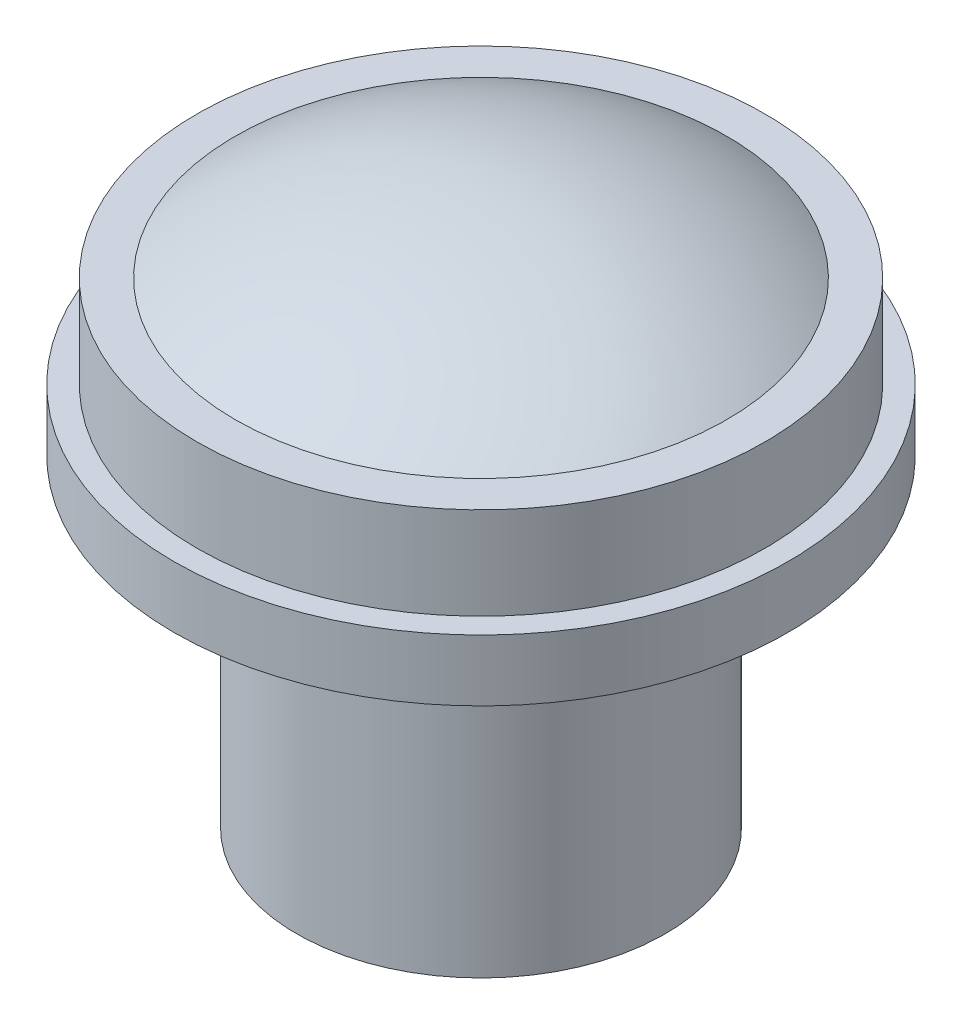
ISO-10303-21;
HEADER;
FILE_DESCRIPTION(('STEP AP214'),'2;1');
FILE_NAME('part.step','',(''),(''),'','','');
FILE_SCHEMA(('AUTOMOTIVE_DESIGN { 1 0 10303 214 1 1 1 1 }'));
ENDSEC;
DATA;
#1=APPLICATION_CONTEXT('core data for automotive mechanical design processes');
#2=APPLICATION_PROTOCOL_DEFINITION('international standard','automotive_design',2000,#1);
#3=PRODUCT_CONTEXT('',#1,'mechanical');
#4=PRODUCT('Part','Part','',(#3));
#5=PRODUCT_RELATED_PRODUCT_CATEGORY('part','',(#4));
#6=PRODUCT_DEFINITION_FORMATION('','',#4);
#7=PRODUCT_DEFINITION_CONTEXT('part definition',#1,'design');
#8=PRODUCT_DEFINITION('design','',#6,#7);
#9=PRODUCT_DEFINITION_SHAPE('','',#8);
#10=(LENGTH_UNIT() NAMED_UNIT(*) SI_UNIT(.MILLI.,.METRE.));
#11=(NAMED_UNIT(*) PLANE_ANGLE_UNIT() SI_UNIT($,.RADIAN.));
#12=(NAMED_UNIT(*) SI_UNIT($,.STERADIAN.) SOLID_ANGLE_UNIT());
#13=UNCERTAINTY_MEASURE_WITH_UNIT(LENGTH_MEASURE(1.E-05),#10,'distance_accuracy_value','');
#14=(GEOMETRIC_REPRESENTATION_CONTEXT(3) GLOBAL_UNCERTAINTY_ASSIGNED_CONTEXT((#13)) GLOBAL_UNIT_ASSIGNED_CONTEXT((#10,
#11,#12)) REPRESENTATION_CONTEXT('',''));
#15=CARTESIAN_POINT('',(0.,0.,0.));
#16=DIRECTION('',(0.,0.,1.));
#17=DIRECTION('',(1.,0.,0.));
#18=AXIS2_PLACEMENT_3D('',#15,#16,#17);
#19=CARTESIAN_POINT('',(0.,12.5,0.));
#20=DIRECTION('',(0.,-1.,0.));
#21=DIRECTION('',(0.,0.,-1.));
#22=AXIS2_PLACEMENT_3D('',#19,#20,#21);
#23=CYLINDRICAL_SURFACE('',#22,9.25);
#24=CARTESIAN_POINT('',(0.,12.5,0.));
#25=DIRECTION('',(0.,1.,0.));
#26=DIRECTION('',(0.,0.,1.));
#27=AXIS2_PLACEMENT_3D('',#24,#25,#26);
#28=CIRCLE('',#27,9.25);
#29=CARTESIAN_POINT('',(0.,12.5,9.25));
#30=VERTEX_POINT('',#29);
#31=EDGE_CURVE('E50',#30,#30,#28,.T.);
#32=ORIENTED_EDGE('',*,*,#31,.T.);
#33=EDGE_LOOP('',(#32));
#34=FACE_BOUND('',#33,.T.);
#35=CARTESIAN_POINT('',(0.,10.5,0.));
#36=DIRECTION('',(0.,1.,0.));
#37=DIRECTION('',(0.,0.,1.));
#38=AXIS2_PLACEMENT_3D('',#35,#36,#37);
#39=CIRCLE('',#38,9.25);
#40=CARTESIAN_POINT('',(0.,10.5,9.25));
#41=VERTEX_POINT('',#40);
#42=EDGE_CURVE('E56',#41,#41,#39,.T.);
#43=ORIENTED_EDGE('',*,*,#42,.F.);
#44=EDGE_LOOP('',(#43));
#45=FACE_BOUND('',#44,.T.);
#46=ADVANCED_FACE('F43',(#34,#45),#23,.F.);
#47=CARTESIAN_POINT('',(0.,12.5,0.));
#48=DIRECTION('',(0.,-1.,0.));
#49=DIRECTION('',(0.,0.,-1.));
#50=AXIS2_PLACEMENT_3D('',#47,#48,#49);
#51=CYLINDRICAL_SURFACE('',#50,10.);
#52=CARTESIAN_POINT('',(0.,12.5,0.));
#53=DIRECTION('',(0.,1.,0.));
#54=DIRECTION('',(0.,0.,1.));
#55=AXIS2_PLACEMENT_3D('',#52,#53,#54);
#56=CIRCLE('',#55,10.);
#57=CARTESIAN_POINT('',(0.,12.5,10.));
#58=VERTEX_POINT('',#57);
#59=EDGE_CURVE('E11',#58,#58,#56,.T.);
#60=ORIENTED_EDGE('',*,*,#59,.F.);
#61=EDGE_LOOP('',(#60));
#62=FACE_BOUND('',#61,.T.);
#63=CARTESIAN_POINT('',(0.,10.5,0.));
#64=DIRECTION('',(0.,1.,0.));
#65=DIRECTION('',(0.,0.,1.));
#66=AXIS2_PLACEMENT_3D('',#63,#64,#65);
#67=CIRCLE('',#66,10.);
#68=CARTESIAN_POINT('',(0.,10.5,10.));
#69=VERTEX_POINT('',#68);
#70=EDGE_CURVE('E46',#69,#69,#67,.T.);
#71=ORIENTED_EDGE('',*,*,#70,.T.);
#72=EDGE_LOOP('',(#71));
#73=FACE_BOUND('',#72,.T.);
#74=ADVANCED_FACE('F63',(#62,#73),#51,.T.);
#75=CARTESIAN_POINT('',(0.,12.5,0.));
#76=DIRECTION('',(0.,1.,0.));
#77=DIRECTION('',(0.,0.,1.));
#78=AXIS2_PLACEMENT_3D('',#75,#76,#77);
#79=PLANE('',#78);
#80=ORIENTED_EDGE('',*,*,#31,.F.);
#81=EDGE_LOOP('',(#80));
#82=FACE_BOUND('',#81,.T.);
#83=ORIENTED_EDGE('',*,*,#59,.T.);
#84=EDGE_LOOP('',(#83));
#85=FACE_BOUND('',#84,.T.);
#86=ADVANCED_FACE('F67',(#82,#85),#79,.T.);
#87=CARTESIAN_POINT('',(0.,10.5,0.));
#88=DIRECTION('',(0.,1.,0.));
#89=DIRECTION('',(0.,0.,1.));
#90=AXIS2_PLACEMENT_3D('',#87,#88,#89);
#91=PLANE('',#90);
#92=ORIENTED_EDGE('',*,*,#42,.T.);
#93=EDGE_LOOP('',(#92));
#94=FACE_BOUND('',#93,.T.);
#95=ORIENTED_EDGE('',*,*,#70,.F.);
#96=EDGE_LOOP('',(#95));
#97=FACE_BOUND('',#96,.T.);
#98=ADVANCED_FACE('F65',(#94,#97),#91,.F.);
#99=CLOSED_SHELL('',(#46,#74,#86,#98));
#100=MANIFOLD_SOLID_BREP('B2',#99);
#101=CARTESIAN_POINT('',(0.,10.4,0.));
#102=DIRECTION('',(0.,1.,0.));
#103=DIRECTION('',(0.,0.,1.));
#104=AXIS2_PLACEMENT_3D('',#101,#102,#103);
#105=CYLINDRICAL_SURFACE('',#104,2.25);
#106=CARTESIAN_POINT('',(0.,10.4,0.));
#107=DIRECTION('',(0.,1.,0.));
#108=DIRECTION('',(0.,0.,1.));
#109=AXIS2_PLACEMENT_3D('',#106,#107,#108);
#110=CIRCLE('',#109,2.25);
#111=CARTESIAN_POINT('',(0.,10.4,2.25));
#112=VERTEX_POINT('',#111);
#113=EDGE_CURVE('E42',#112,#112,#110,.F.);
#114=ORIENTED_EDGE('',*,*,#113,.F.);
#115=EDGE_LOOP('',(#114));
#116=FACE_BOUND('',#115,.T.);
#117=CARTESIAN_POINT('',(0.,10.5,0.));
#118=DIRECTION('',(0.,1.,0.));
#119=DIRECTION('',(0.,0.,1.));
#120=AXIS2_PLACEMENT_3D('',#117,#118,#119);
#121=CIRCLE('',#120,2.25);
#122=CARTESIAN_POINT('',(0.,10.5,2.25));
#123=VERTEX_POINT('',#122);
#124=EDGE_CURVE('E116',#123,#123,#121,.F.);
#125=ORIENTED_EDGE('',*,*,#124,.T.);
#126=EDGE_LOOP('',(#125));
#127=FACE_BOUND('',#126,.T.);
#128=ADVANCED_FACE('F112',(#116,#127),#105,.T.);
#129=CARTESIAN_POINT('',(0.,10.4,0.));
#130=DIRECTION('',(0.,1.,0.));
#131=DIRECTION('',(0.,0.,1.));
#132=AXIS2_PLACEMENT_3D('',#129,#130,#131);
#133=PLANE('',#132);
#134=ORIENTED_EDGE('',*,*,#113,.T.);
#135=EDGE_LOOP('',(#134));
#136=FACE_BOUND('',#135,.T.);
#137=ADVANCED_FACE('F127',(#136),#133,.F.);
#138=CARTESIAN_POINT('',(0.,10.7375,0.));
#139=DIRECTION('',(0.,0.,1.));
#140=DIRECTION('',(1.,0.,0.));
#141=AXIS2_PLACEMENT_3D('',#138,#139,#140);
#142=SPHERICAL_SURFACE('',#141,2.2625);
#143=CARTESIAN_POINT('',(0.,10.7375,0.));
#144=DIRECTION('',(0.,1.,0.));
#145=DIRECTION('',(0.,0.,1.));
#146=AXIS2_PLACEMENT_3D('',#143,#144,#145);
#147=SPHERICAL_SURFACE('',#146,2.2625);
#148=ORIENTED_EDGE('',*,*,#124,.F.);
#149=EDGE_LOOP('',(#148));
#150=FACE_BOUND('',#149,.T.);
#151=ADVANCED_FACE('F114',(#150),#147,.T.);
#152=CLOSED_SHELL('',(#128,#137,#151));
#153=MANIFOLD_SOLID_BREP('B6',#152);
#154=CARTESIAN_POINT('',(0.,15.5,0.));
#155=DIRECTION('',(0.,-1.,0.));
#156=DIRECTION('',(0.,0.,-1.));
#157=AXIS2_PLACEMENT_3D('',#154,#155,#156);
#158=CYLINDRICAL_SURFACE('',#157,8.);
#159=CARTESIAN_POINT('',(0.,15.5,0.));
#160=DIRECTION('',(0.,1.,0.));
#161=DIRECTION('',(0.,0.,1.));
#162=AXIS2_PLACEMENT_3D('',#159,#160,#161);
#163=CIRCLE('',#162,8.);
#164=CARTESIAN_POINT('',(0.,15.5,8.));
#165=VERTEX_POINT('',#164);
#166=EDGE_CURVE('E111',#165,#165,#163,.T.);
#167=ORIENTED_EDGE('',*,*,#166,.F.);
#168=EDGE_LOOP('',(#167));
#169=FACE_BOUND('',#168,.T.);
#170=CARTESIAN_POINT('',(0.,10.5,0.));
#171=DIRECTION('',(0.,1.,0.));
#172=DIRECTION('',(0.,0.,1.));
#173=AXIS2_PLACEMENT_3D('',#170,#171,#172);
#174=CIRCLE('',#173,8.);
#175=CARTESIAN_POINT('',(0.,10.5,8.));
#176=VERTEX_POINT('',#175);
#177=EDGE_CURVE('E170',#176,#176,#174,.T.);
#178=ORIENTED_EDGE('',*,*,#177,.T.);
#179=EDGE_LOOP('',(#178));
#180=FACE_BOUND('',#179,.T.);
#181=ADVANCED_FACE('F163',(#169,#180),#158,.T.);
#182=CARTESIAN_POINT('',(0.,3.95,0.));
#183=DIRECTION('',(0.,0.,1.));
#184=DIRECTION('',(1.,0.,0.));
#185=AXIS2_PLACEMENT_3D('',#182,#183,#184);
#186=SPHERICAL_SURFACE('',#185,14.05);
#187=CARTESIAN_POINT('',(0.,3.95,0.));
#188=DIRECTION('',(0.,1.,0.));
#189=DIRECTION('',(0.,0.,1.));
#190=AXIS2_PLACEMENT_3D('',#187,#188,#189);
#191=SPHERICAL_SURFACE('',#190,14.05);
#192=ORIENTED_EDGE('',*,*,#166,.T.);
#193=EDGE_LOOP('',(#192));
#194=FACE_BOUND('',#193,.T.);
#195=ADVANCED_FACE('F165',(#194),#191,.T.);
#196=CARTESIAN_POINT('',(0.,10.5,0.));
#197=DIRECTION('',(0.,1.,0.));
#198=DIRECTION('',(0.,0.,1.));
#199=AXIS2_PLACEMENT_3D('',#196,#197,#198);
#200=PLANE('',#199);
#201=ORIENTED_EDGE('',*,*,#177,.F.);
#202=EDGE_LOOP('',(#201));
#203=FACE_BOUND('',#202,.T.);
#204=ADVANCED_FACE('F177',(#203),#200,.F.);
#205=CLOSED_SHELL('',(#181,#195,#204));
#206=MANIFOLD_SOLID_BREP('B37',#205);
#207=CARTESIAN_POINT('',(0.,15.5,0.));
#208=DIRECTION('',(0.,-1.,0.));
#209=DIRECTION('',(0.,0.,-1.));
#210=AXIS2_PLACEMENT_3D('',#207,#208,#209);
#211=CYLINDRICAL_SURFACE('',#210,8.);
#212=CARTESIAN_POINT('',(0.,15.5,0.));
#213=DIRECTION('',(0.,1.,0.));
#214=DIRECTION('',(0.,0.,1.));
#215=AXIS2_PLACEMENT_3D('',#212,#213,#214);
#216=CIRCLE('',#215,8.);
#217=CARTESIAN_POINT('',(0.,15.5,8.));
#218=VERTEX_POINT('',#217);
#219=EDGE_CURVE('E217',#218,#218,#216,.T.);
#220=ORIENTED_EDGE('',*,*,#219,.T.);
#221=EDGE_LOOP('',(#220));
#222=FACE_BOUND('',#221,.T.);
#223=CARTESIAN_POINT('',(0.,10.5,0.));
#224=DIRECTION('',(0.,1.,0.));
#225=DIRECTION('',(0.,0.,1.));
#226=AXIS2_PLACEMENT_3D('',#223,#224,#225);
#227=CIRCLE('',#226,8.);
#228=CARTESIAN_POINT('',(0.,10.5,8.));
#229=VERTEX_POINT('',#228);
#230=EDGE_CURVE('E223',#229,#229,#227,.T.);
#231=ORIENTED_EDGE('',*,*,#230,.F.);
#232=EDGE_LOOP('',(#231));
#233=FACE_BOUND('',#232,.T.);
#234=ADVANCED_FACE('F210',(#222,#233),#211,.F.);
#235=CARTESIAN_POINT('',(0.,15.5,0.));
#236=DIRECTION('',(0.,-1.,0.));
#237=DIRECTION('',(0.,0.,-1.));
#238=AXIS2_PLACEMENT_3D('',#235,#236,#237);
#239=CYLINDRICAL_SURFACE('',#238,9.25);
#240=CARTESIAN_POINT('',(0.,15.5,0.));
#241=DIRECTION('',(0.,1.,0.));
#242=DIRECTION('',(0.,0.,1.));
#243=AXIS2_PLACEMENT_3D('',#240,#241,#242);
#244=CIRCLE('',#243,9.25);
#245=CARTESIAN_POINT('',(0.,15.5,9.25));
#246=VERTEX_POINT('',#245);
#247=EDGE_CURVE('E162',#246,#246,#244,.T.);
#248=ORIENTED_EDGE('',*,*,#247,.F.);
#249=EDGE_LOOP('',(#248));
#250=FACE_BOUND('',#249,.T.);
#251=CARTESIAN_POINT('',(0.,10.5,0.));
#252=DIRECTION('',(0.,1.,0.));
#253=DIRECTION('',(0.,0.,1.));
#254=AXIS2_PLACEMENT_3D('',#251,#252,#253);
#255=CIRCLE('',#254,9.25);
#256=CARTESIAN_POINT('',(0.,10.5,9.25));
#257=VERTEX_POINT('',#256);
#258=EDGE_CURVE('E213',#257,#257,#255,.T.);
#259=ORIENTED_EDGE('',*,*,#258,.T.);
#260=EDGE_LOOP('',(#259));
#261=FACE_BOUND('',#260,.T.);
#262=ADVANCED_FACE('F230',(#250,#261),#239,.T.);
#263=CARTESIAN_POINT('',(0.,15.5,0.));
#264=DIRECTION('',(0.,1.,0.));
#265=DIRECTION('',(0.,0.,1.));
#266=AXIS2_PLACEMENT_3D('',#263,#264,#265);
#267=PLANE('',#266);
#268=ORIENTED_EDGE('',*,*,#219,.F.);
#269=EDGE_LOOP('',(#268));
#270=FACE_BOUND('',#269,.T.);
#271=ORIENTED_EDGE('',*,*,#247,.T.);
#272=EDGE_LOOP('',(#271));
#273=FACE_BOUND('',#272,.T.);
#274=ADVANCED_FACE('F234',(#270,#273),#267,.T.);
#275=CARTESIAN_POINT('',(0.,10.5,0.));
#276=DIRECTION('',(0.,1.,0.));
#277=DIRECTION('',(0.,0.,1.));
#278=AXIS2_PLACEMENT_3D('',#275,#276,#277);
#279=PLANE('',#278);
#280=ORIENTED_EDGE('',*,*,#230,.T.);
#281=EDGE_LOOP('',(#280));
#282=FACE_BOUND('',#281,.T.);
#283=ORIENTED_EDGE('',*,*,#258,.F.);
#284=EDGE_LOOP('',(#283));
#285=FACE_BOUND('',#284,.T.);
#286=ADVANCED_FACE('F232',(#282,#285),#279,.F.);
#287=CLOSED_SHELL('',(#234,#262,#274,#286));
#288=MANIFOLD_SOLID_BREP('B106',#287);
#289=CARTESIAN_POINT('',(0.,10.5,0.));
#290=DIRECTION('',(0.,1.,0.));
#291=DIRECTION('',(0.,0.,1.));
#292=AXIS2_PLACEMENT_3D('',#289,#290,#291);
#293=PLANE('',#292);
#294=CARTESIAN_POINT('',(0.,10.5,0.));
#295=DIRECTION('',(0.,1.,0.));
#296=DIRECTION('',(0.,0.,1.));
#297=AXIS2_PLACEMENT_3D('',#294,#295,#296);
#298=CIRCLE('',#297,6.);
#299=CARTESIAN_POINT('',(0.,10.5,-6.));
#300=VERTEX_POINT('',#299);
#301=EDGE_CURVE('E209',#300,#300,#298,.T.);
#302=ORIENTED_EDGE('',*,*,#301,.T.);
#303=EDGE_LOOP('',(#302));
#304=FACE_BOUND('',#303,.T.);
#305=CARTESIAN_POINT('',(0.,10.5,0.));
#306=DIRECTION('',(0.,1.,0.));
#307=DIRECTION('',(0.,0.,1.));
#308=AXIS2_PLACEMENT_3D('',#305,#306,#307);
#309=CIRCLE('',#308,2.25);
#310=CARTESIAN_POINT('',(0.,10.5,-2.25));
#311=VERTEX_POINT('',#310);
#312=EDGE_CURVE('E282',#311,#311,#309,.T.);
#313=ORIENTED_EDGE('',*,*,#312,.F.);
#314=EDGE_LOOP('',(#313));
#315=FACE_BOUND('',#314,.T.);
#316=ADVANCED_FACE('F271',(#304,#315),#293,.T.);
#317=CARTESIAN_POINT('',(0.,0.,0.));
#318=DIRECTION('',(0.,1.,0.));
#319=DIRECTION('',(0.,0.,1.));
#320=AXIS2_PLACEMENT_3D('',#317,#318,#319);
#321=PLANE('',#320);
#322=CARTESIAN_POINT('',(0.,0.,0.));
#323=DIRECTION('',(0.,1.,0.));
#324=DIRECTION('',(0.,0.,1.));
#325=AXIS2_PLACEMENT_3D('',#322,#323,#324);
#326=CIRCLE('',#325,6.);
#327=CARTESIAN_POINT('',(0.,0.,-6.));
#328=VERTEX_POINT('',#327);
#329=EDGE_CURVE('E275',#328,#328,#326,.T.);
#330=ORIENTED_EDGE('',*,*,#329,.F.);
#331=EDGE_LOOP('',(#330));
#332=FACE_BOUND('',#331,.T.);
#333=CARTESIAN_POINT('',(0.,0.,0.));
#334=DIRECTION('',(0.,1.,0.));
#335=DIRECTION('',(0.,0.,1.));
#336=AXIS2_PLACEMENT_3D('',#333,#334,#335);
#337=CIRCLE('',#336,2.25);
#338=CARTESIAN_POINT('',(0.,0.,-2.25));
#339=VERTEX_POINT('',#338);
#340=EDGE_CURVE('E284',#339,#339,#337,.T.);
#341=ORIENTED_EDGE('',*,*,#340,.T.);
#342=EDGE_LOOP('',(#341));
#343=FACE_BOUND('',#342,.T.);
#344=ADVANCED_FACE('F294',(#332,#343),#321,.F.);
#345=CARTESIAN_POINT('',(0.,10.5,0.));
#346=DIRECTION('',(0.,-1.,0.));
#347=DIRECTION('',(0.,0.,-1.));
#348=AXIS2_PLACEMENT_3D('',#345,#346,#347);
#349=CYLINDRICAL_SURFACE('',#348,6.);
#350=CARTESIAN_POINT('',(0.,10.5,-6.));
#351=CARTESIAN_POINT('',(0.,10.390625,-6.));
#352=CARTESIAN_POINT('',(0.,10.28125,-6.));
#353=CARTESIAN_POINT('',(0.,10.0625,-6.));
#354=CARTESIAN_POINT('',(0.,9.953125,-6.));
#355=CARTESIAN_POINT('',(0.,9.734375,-6.));
#356=CARTESIAN_POINT('',(0.,9.625,-6.));
#357=CARTESIAN_POINT('',(0.,9.40625,-6.));
#358=CARTESIAN_POINT('',(0.,9.296875,-6.));
#359=CARTESIAN_POINT('',(0.,9.078125,-6.));
#360=CARTESIAN_POINT('',(0.,8.96875,-6.));
#361=CARTESIAN_POINT('',(0.,8.75,-6.));
#362=CARTESIAN_POINT('',(0.,8.640625,-6.));
#363=CARTESIAN_POINT('',(0.,8.421875,-6.));
#364=CARTESIAN_POINT('',(0.,8.3125,-6.));
#365=CARTESIAN_POINT('',(0.,8.09375,-6.));
#366=CARTESIAN_POINT('',(0.,7.984375,-6.));
#367=CARTESIAN_POINT('',(0.,7.765625,-6.));
#368=CARTESIAN_POINT('',(0.,7.65625,-6.));
#369=CARTESIAN_POINT('',(0.,7.4375,-6.));
#370=CARTESIAN_POINT('',(0.,7.328125,-6.));
#371=CARTESIAN_POINT('',(0.,7.109375,-6.));
#372=CARTESIAN_POINT('',(0.,7.,-6.));
#373=CARTESIAN_POINT('',(0.,6.78125,-6.));
#374=CARTESIAN_POINT('',(0.,6.671875,-6.));
#375=CARTESIAN_POINT('',(0.,6.453125,-6.));
#376=CARTESIAN_POINT('',(0.,6.34375,-6.));
#377=CARTESIAN_POINT('',(0.,6.125,-6.));
#378=CARTESIAN_POINT('',(0.,6.015625,-6.));
#379=CARTESIAN_POINT('',(0.,5.796875,-6.));
#380=CARTESIAN_POINT('',(0.,5.6875,-6.));
#381=CARTESIAN_POINT('',(0.,5.46875,-6.));
#382=CARTESIAN_POINT('',(0.,5.359375,-6.));
#383=CARTESIAN_POINT('',(0.,5.140625,-6.));
#384=CARTESIAN_POINT('',(0.,5.03125,-6.));
#385=CARTESIAN_POINT('',(0.,4.8125,-6.));
#386=CARTESIAN_POINT('',(0.,4.703125,-6.));
#387=CARTESIAN_POINT('',(0.,4.484375,-6.));
#388=CARTESIAN_POINT('',(0.,4.375,-6.));
#389=CARTESIAN_POINT('',(0.,4.15625,-6.));
#390=CARTESIAN_POINT('',(0.,4.046875,-6.));
#391=CARTESIAN_POINT('',(0.,3.828125,-6.));
#392=CARTESIAN_POINT('',(0.,3.71875,-6.));
#393=CARTESIAN_POINT('',(0.,3.5,-6.));
#394=CARTESIAN_POINT('',(0.,3.390625,-6.));
#395=CARTESIAN_POINT('',(0.,3.171875,-6.));
#396=CARTESIAN_POINT('',(0.,3.0625,-6.));
#397=CARTESIAN_POINT('',(0.,2.84375,-6.));
#398=CARTESIAN_POINT('',(0.,2.734375,-6.));
#399=CARTESIAN_POINT('',(0.,2.515625,-6.));
#400=CARTESIAN_POINT('',(0.,2.40625,-6.));
#401=CARTESIAN_POINT('',(0.,2.1875,-6.));
#402=CARTESIAN_POINT('',(0.,2.078125,-6.));
#403=CARTESIAN_POINT('',(0.,1.859375,-6.));
#404=CARTESIAN_POINT('',(0.,1.75,-6.));
#405=CARTESIAN_POINT('',(0.,1.53125,-6.));
#406=CARTESIAN_POINT('',(0.,1.421875,-6.));
#407=CARTESIAN_POINT('',(0.,1.203125,-6.));
#408=CARTESIAN_POINT('',(0.,1.09375,-6.));
#409=CARTESIAN_POINT('',(0.,0.875000000000001,-6.));
#410=CARTESIAN_POINT('',(0.,0.765625000000001,-6.));
#411=CARTESIAN_POINT('',(0.,0.546875,-6.));
#412=CARTESIAN_POINT('',(0.,0.4375,-6.));
#413=CARTESIAN_POINT('',(0.,0.21875,-6.));
#414=CARTESIAN_POINT('',(0.,0.109375,-6.));
#415=CARTESIAN_POINT('',(0.,0.,-6.));
#416=B_SPLINE_CURVE_WITH_KNOTS('',3,(#350,#351,#352,#353,#354,#355,#356,#357,#358,#359,#360,
#361,#362,#363,#364,#365,#366,#367,#368,#369,#370,#371,#372,#373,#374,#375,#376,#377,#378,#379,
#380,#381,#382,#383,#384,#385,#386,#387,#388,#389,#390,#391,#392,#393,#394,#395,#396,#397,#398,
#399,#400,#401,#402,#403,#404,#405,#406,#407,#408,#409,#410,#411,#412,#413,#414,#415),
.UNSPECIFIED.,.F.,.F.,(4,2,2,2,2,2,2,2,2,2,2,2,2,2,2,2,2,2,2,2,2,2,2,2,2,2,2,2,2,2,2,2,4),(0.,
0.328124999999999,0.656249999999999,0.984374999999999,1.3125,1.640625,1.96875,2.296875,2.625,
2.953125,3.28125,3.609375,3.9375,4.265625,4.59375,4.921875,5.25,5.578125,5.90625,6.234375,
6.5625,6.890625,7.21875,7.546875,7.875,8.203125,8.53125,8.859375,9.1875,9.515625,9.84375,
10.171875,10.5),.UNSPECIFIED.);
#417=EDGE_CURVE('BSEAM273',#300,#328,#416,.T.);
#418=ORIENTED_EDGE('',*,*,#301,.F.);
#419=ORIENTED_EDGE('',*,*,#329,.T.);
#420=ORIENTED_EDGE('',*,*,#417,.T.);
#421=ORIENTED_EDGE('',*,*,#417,.F.);
#422=EDGE_LOOP('',(#418,#420,#419,#421));
#423=FACE_BOUND('',#422,.T.);
#424=ADVANCED_FACE('F273',(#423),#349,.T.);
#425=CARTESIAN_POINT('',(0.,10.5,0.));
#426=DIRECTION('',(0.,-1.,0.));
#427=DIRECTION('',(0.,0.,-1.));
#428=AXIS2_PLACEMENT_3D('',#425,#426,#427);
#429=CYLINDRICAL_SURFACE('',#428,2.25);
#430=CARTESIAN_POINT('',(0.,10.5,-2.25));
#431=CARTESIAN_POINT('',(0.,10.390625,-2.25));
#432=CARTESIAN_POINT('',(0.,10.28125,-2.25));
#433=CARTESIAN_POINT('',(0.,10.0625,-2.25));
#434=CARTESIAN_POINT('',(0.,9.953125,-2.25));
#435=CARTESIAN_POINT('',(0.,9.734375,-2.25));
#436=CARTESIAN_POINT('',(0.,9.625,-2.25));
#437=CARTESIAN_POINT('',(0.,9.40625,-2.25));
#438=CARTESIAN_POINT('',(0.,9.296875,-2.25));
#439=CARTESIAN_POINT('',(0.,9.078125,-2.25));
#440=CARTESIAN_POINT('',(0.,8.96875,-2.25));
#441=CARTESIAN_POINT('',(0.,8.75,-2.25));
#442=CARTESIAN_POINT('',(0.,8.640625,-2.25));
#443=CARTESIAN_POINT('',(0.,8.421875,-2.25));
#444=CARTESIAN_POINT('',(0.,8.3125,-2.25));
#445=CARTESIAN_POINT('',(0.,8.09375,-2.25));
#446=CARTESIAN_POINT('',(0.,7.984375,-2.25));
#447=CARTESIAN_POINT('',(0.,7.765625,-2.25));
#448=CARTESIAN_POINT('',(0.,7.65625,-2.25));
#449=CARTESIAN_POINT('',(0.,7.4375,-2.25));
#450=CARTESIAN_POINT('',(0.,7.328125,-2.25));
#451=CARTESIAN_POINT('',(0.,7.109375,-2.25));
#452=CARTESIAN_POINT('',(0.,7.,-2.25));
#453=CARTESIAN_POINT('',(0.,6.78125,-2.25));
#454=CARTESIAN_POINT('',(0.,6.671875,-2.25));
#455=CARTESIAN_POINT('',(0.,6.453125,-2.25));
#456=CARTESIAN_POINT('',(0.,6.34375,-2.25));
#457=CARTESIAN_POINT('',(0.,6.125,-2.25));
#458=CARTESIAN_POINT('',(0.,6.015625,-2.25));
#459=CARTESIAN_POINT('',(0.,5.796875,-2.25));
#460=CARTESIAN_POINT('',(0.,5.6875,-2.25));
#461=CARTESIAN_POINT('',(0.,5.46875,-2.25));
#462=CARTESIAN_POINT('',(0.,5.359375,-2.25));
#463=CARTESIAN_POINT('',(0.,5.140625,-2.25));
#464=CARTESIAN_POINT('',(0.,5.03125,-2.25));
#465=CARTESIAN_POINT('',(0.,4.8125,-2.25));
#466=CARTESIAN_POINT('',(0.,4.703125,-2.25));
#467=CARTESIAN_POINT('',(0.,4.484375,-2.25));
#468=CARTESIAN_POINT('',(0.,4.375,-2.25));
#469=CARTESIAN_POINT('',(0.,4.15625,-2.25));
#470=CARTESIAN_POINT('',(0.,4.046875,-2.25));
#471=CARTESIAN_POINT('',(0.,3.828125,-2.25));
#472=CARTESIAN_POINT('',(0.,3.71875,-2.25));
#473=CARTESIAN_POINT('',(0.,3.5,-2.25));
#474=CARTESIAN_POINT('',(0.,3.390625,-2.25));
#475=CARTESIAN_POINT('',(0.,3.171875,-2.25));
#476=CARTESIAN_POINT('',(0.,3.0625,-2.25));
#477=CARTESIAN_POINT('',(0.,2.84375,-2.25));
#478=CARTESIAN_POINT('',(0.,2.734375,-2.25));
#479=CARTESIAN_POINT('',(0.,2.515625,-2.25));
#480=CARTESIAN_POINT('',(0.,2.40625,-2.25));
#481=CARTESIAN_POINT('',(0.,2.1875,-2.25));
#482=CARTESIAN_POINT('',(0.,2.078125,-2.25));
#483=CARTESIAN_POINT('',(0.,1.859375,-2.25));
#484=CARTESIAN_POINT('',(0.,1.75,-2.25));
#485=CARTESIAN_POINT('',(0.,1.53125,-2.25));
#486=CARTESIAN_POINT('',(0.,1.421875,-2.25));
#487=CARTESIAN_POINT('',(0.,1.203125,-2.25));
#488=CARTESIAN_POINT('',(0.,1.09375,-2.25));
#489=CARTESIAN_POINT('',(0.,0.875000000000001,-2.25));
#490=CARTESIAN_POINT('',(0.,0.765625000000001,-2.25));
#491=CARTESIAN_POINT('',(0.,0.546875,-2.25));
#492=CARTESIAN_POINT('',(0.,0.4375,-2.25));
#493=CARTESIAN_POINT('',(0.,0.21875,-2.25));
#494=CARTESIAN_POINT('',(0.,0.109375,-2.25));
#495=CARTESIAN_POINT('',(0.,0.,-2.25));
#496=B_SPLINE_CURVE_WITH_KNOTS('',3,(#430,#431,#432,#433,#434,#435,#436,#437,#438,#439,#440,
#441,#442,#443,#444,#445,#446,#447,#448,#449,#450,#451,#452,#453,#454,#455,#456,#457,#458,#459,
#460,#461,#462,#463,#464,#465,#466,#467,#468,#469,#470,#471,#472,#473,#474,#475,#476,#477,#478,
#479,#480,#481,#482,#483,#484,#485,#486,#487,#488,#489,#490,#491,#492,#493,#494,#495),
.UNSPECIFIED.,.F.,.F.,(4,2,2,2,2,2,2,2,2,2,2,2,2,2,2,2,2,2,2,2,2,2,2,2,2,2,2,2,2,2,2,2,4),(0.,
0.328125,0.656250000000001,0.984375000000001,1.3125,1.640625,1.96875,2.296875,2.625,2.953125,
3.28125,3.609375,3.9375,4.265625,4.59375,4.921875,5.25,5.578125,5.90625,6.234375,6.5625,
6.890625,7.21875,7.546875,7.875,8.203125,8.53125,8.859375,9.1875,9.515625,9.84375,10.171875,
10.5),.UNSPECIFIED.);
#497=EDGE_CURVE('BSEAM290',#311,#339,#496,.T.);
#498=ORIENTED_EDGE('',*,*,#312,.T.);
#499=ORIENTED_EDGE('',*,*,#340,.F.);
#500=ORIENTED_EDGE('',*,*,#497,.T.);
#501=ORIENTED_EDGE('',*,*,#497,.F.);
#502=EDGE_LOOP('',(#498,#500,#499,#501));
#503=FACE_BOUND('',#502,.T.);
#504=ADVANCED_FACE('F290',(#503),#429,.F.);
#505=CLOSED_SHELL('',(#316,#344,#424,#504));
#506=MANIFOLD_SOLID_BREP('B157',#505);
#507=ADVANCED_BREP_SHAPE_REPRESENTATION('',(#18,#100,#153,#206,#288,#506),#14);
#508=SHAPE_DEFINITION_REPRESENTATION(#9,#507);
ENDSEC;
END-ISO-10303-21;
